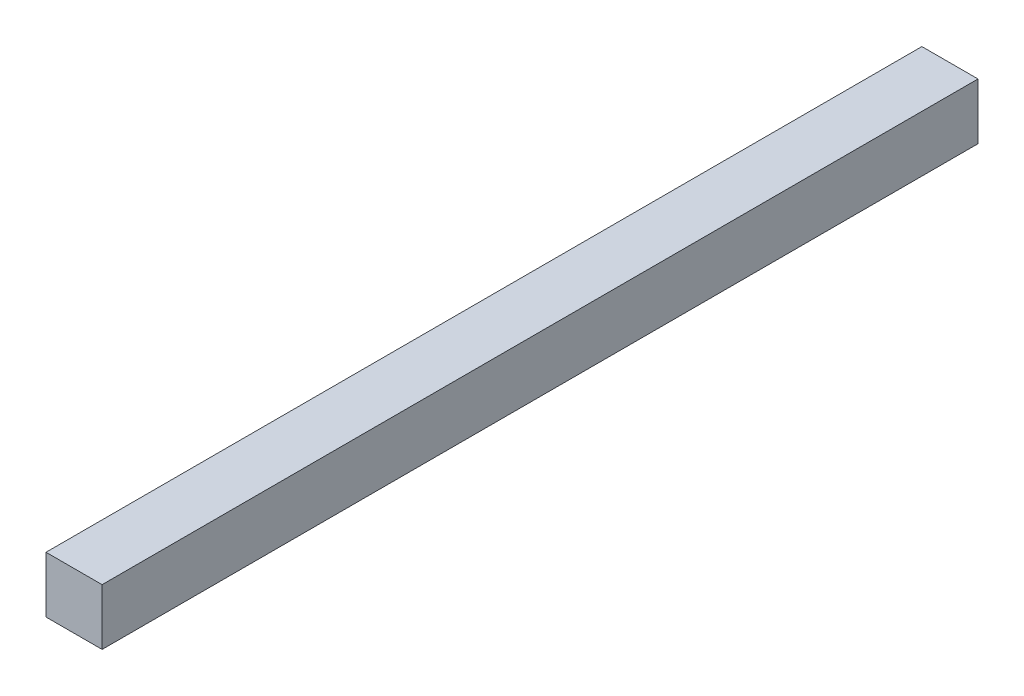
ISO-10303-21;
HEADER;
FILE_DESCRIPTION(('STEP AP214'),'2;1');
FILE_NAME('part.step','',(''),(''),'','','');
FILE_SCHEMA(('AUTOMOTIVE_DESIGN { 1 0 10303 214 1 1 1 1 }'));
ENDSEC;
DATA;
#1=APPLICATION_CONTEXT('core data for automotive mechanical design processes');
#2=APPLICATION_PROTOCOL_DEFINITION('international standard','automotive_design',2000,#1);
#3=PRODUCT_CONTEXT('',#1,'mechanical');
#4=PRODUCT('Part','Part','',(#3));
#5=PRODUCT_RELATED_PRODUCT_CATEGORY('part','',(#4));
#6=PRODUCT_DEFINITION_FORMATION('','',#4);
#7=PRODUCT_DEFINITION_CONTEXT('part definition',#1,'design');
#8=PRODUCT_DEFINITION('design','',#6,#7);
#9=PRODUCT_DEFINITION_SHAPE('','',#8);
#10=(LENGTH_UNIT() NAMED_UNIT(*) SI_UNIT(.MILLI.,.METRE.));
#11=(NAMED_UNIT(*) PLANE_ANGLE_UNIT() SI_UNIT($,.RADIAN.));
#12=(NAMED_UNIT(*) SI_UNIT($,.STERADIAN.) SOLID_ANGLE_UNIT());
#13=UNCERTAINTY_MEASURE_WITH_UNIT(LENGTH_MEASURE(1.E-05),#10,'distance_accuracy_value','');
#14=(GEOMETRIC_REPRESENTATION_CONTEXT(3) GLOBAL_UNCERTAINTY_ASSIGNED_CONTEXT((#13)) GLOBAL_UNIT_ASSIGNED_CONTEXT((#10,
#11,#12)) REPRESENTATION_CONTEXT('',''));
#15=CARTESIAN_POINT('',(0.,0.,0.));
#16=DIRECTION('',(0.,0.,1.));
#17=DIRECTION('',(1.,0.,0.));
#18=AXIS2_PLACEMENT_3D('',#15,#16,#17);
#19=CARTESIAN_POINT('',(10.,-10.,312.2));
#20=DIRECTION('',(-1.,0.,0.));
#21=DIRECTION('',(0.,0.,1.));
#22=AXIS2_PLACEMENT_3D('',#19,#20,#21);
#23=PLANE('',#22);
#24=DIRECTION('',(0.,1.,0.));
#25=VECTOR('',#24,1.);
#26=CARTESIAN_POINT('',(10.,-10.,0.));
#27=LINE('',#26,#25);
#28=CARTESIAN_POINT('',(10.,-10.,0.));
#29=VERTEX_POINT('',#28);
#30=CARTESIAN_POINT('',(10.,10.,0.));
#31=VERTEX_POINT('',#30);
#32=EDGE_CURVE('E98',#29,#31,#27,.T.);
#33=ORIENTED_EDGE('',*,*,#32,.T.);
#34=DIRECTION('',(0.,0.,-1.));
#35=VECTOR('',#34,1.);
#36=CARTESIAN_POINT('',(10.,10.,312.2));
#37=LINE('',#36,#35);
#38=CARTESIAN_POINT('',(10.,10.,312.2));
#39=VERTEX_POINT('',#38);
#40=EDGE_CURVE('E11',#39,#31,#37,.T.);
#41=ORIENTED_EDGE('',*,*,#40,.F.);
#42=DIRECTION('',(0.,1.,0.));
#43=VECTOR('',#42,1.);
#44=CARTESIAN_POINT('',(10.,-10.,312.2));
#45=LINE('',#44,#43);
#46=CARTESIAN_POINT('',(10.,-10.,312.2));
#47=VERTEX_POINT('',#46);
#48=EDGE_CURVE('E86',#47,#39,#45,.T.);
#49=ORIENTED_EDGE('',*,*,#48,.F.);
#50=DIRECTION('',(0.,0.,-1.));
#51=VECTOR('',#50,1.);
#52=CARTESIAN_POINT('',(10.,-10.,312.2));
#53=LINE('',#52,#51);
#54=EDGE_CURVE('E94',#47,#29,#53,.T.);
#55=ORIENTED_EDGE('',*,*,#54,.T.);
#56=EDGE_LOOP('',(#33,#41,#49,#55));
#57=FACE_BOUND('',#56,.T.);
#58=ADVANCED_FACE('F35',(#57),#23,.F.);
#59=CARTESIAN_POINT('',(-10.,10.,312.2));
#60=DIRECTION('',(0.,-1.,0.));
#61=DIRECTION('',(0.,0.,-1.));
#62=AXIS2_PLACEMENT_3D('',#59,#60,#61);
#63=PLANE('',#62);
#64=DIRECTION('',(-1.,0.,0.));
#65=VECTOR('',#64,1.);
#66=CARTESIAN_POINT('',(-10.,10.,0.));
#67=LINE('',#66,#65);
#68=CARTESIAN_POINT('',(-10.,10.,0.));
#69=VERTEX_POINT('',#68);
#70=EDGE_CURVE('E90',#31,#69,#67,.T.);
#71=ORIENTED_EDGE('',*,*,#70,.T.);
#72=DIRECTION('',(0.,0.,-1.));
#73=VECTOR('',#72,1.);
#74=CARTESIAN_POINT('',(-10.,10.,312.2));
#75=LINE('',#74,#73);
#76=CARTESIAN_POINT('',(-10.,10.,312.2));
#77=VERTEX_POINT('',#76);
#78=EDGE_CURVE('E43',#77,#69,#75,.T.);
#79=ORIENTED_EDGE('',*,*,#78,.F.);
#80=DIRECTION('',(-1.,0.,0.));
#81=VECTOR('',#80,1.);
#82=CARTESIAN_POINT('',(-10.,10.,312.2));
#83=LINE('',#82,#81);
#84=EDGE_CURVE('E81',#39,#77,#83,.T.);
#85=ORIENTED_EDGE('',*,*,#84,.F.);
#86=ORIENTED_EDGE('',*,*,#40,.T.);
#87=EDGE_LOOP('',(#71,#79,#85,#86));
#88=FACE_BOUND('',#87,.T.);
#89=ADVANCED_FACE('F89',(#88),#63,.F.);
#90=CARTESIAN_POINT('',(-10.,-10.,312.2));
#91=DIRECTION('',(1.,0.,0.));
#92=DIRECTION('',(0.,0.,-1.));
#93=AXIS2_PLACEMENT_3D('',#90,#91,#92);
#94=PLANE('',#93);
#95=DIRECTION('',(0.,-1.,0.));
#96=VECTOR('',#95,1.);
#97=CARTESIAN_POINT('',(-10.,-10.,0.));
#98=LINE('',#97,#96);
#99=CARTESIAN_POINT('',(-10.,-10.,0.));
#100=VERTEX_POINT('',#99);
#101=EDGE_CURVE('E68',#69,#100,#98,.T.);
#102=ORIENTED_EDGE('',*,*,#101,.T.);
#103=DIRECTION('',(0.,0.,-1.));
#104=VECTOR('',#103,1.);
#105=CARTESIAN_POINT('',(-10.,-10.,312.2));
#106=LINE('',#105,#104);
#107=CARTESIAN_POINT('',(-10.,-10.,312.2));
#108=VERTEX_POINT('',#107);
#109=EDGE_CURVE('E91',#108,#100,#106,.T.);
#110=ORIENTED_EDGE('',*,*,#109,.F.);
#111=DIRECTION('',(0.,-1.,0.));
#112=VECTOR('',#111,1.);
#113=CARTESIAN_POINT('',(-10.,-10.,312.2));
#114=LINE('',#113,#112);
#115=EDGE_CURVE('E84',#77,#108,#114,.T.);
#116=ORIENTED_EDGE('',*,*,#115,.F.);
#117=ORIENTED_EDGE('',*,*,#78,.T.);
#118=EDGE_LOOP('',(#102,#110,#116,#117));
#119=FACE_BOUND('',#118,.T.);
#120=ADVANCED_FACE('F92',(#119),#94,.F.);
#121=CARTESIAN_POINT('',(-10.,-10.,312.2));
#122=DIRECTION('',(0.,1.,0.));
#123=DIRECTION('',(0.,0.,1.));
#124=AXIS2_PLACEMENT_3D('',#121,#122,#123);
#125=PLANE('',#124);
#126=DIRECTION('',(1.,0.,0.));
#127=VECTOR('',#126,1.);
#128=CARTESIAN_POINT('',(-10.,-10.,0.));
#129=LINE('',#128,#127);
#130=EDGE_CURVE('E74',#100,#29,#129,.T.);
#131=ORIENTED_EDGE('',*,*,#130,.T.);
#132=ORIENTED_EDGE('',*,*,#54,.F.);
#133=DIRECTION('',(1.,0.,0.));
#134=VECTOR('',#133,1.);
#135=CARTESIAN_POINT('',(-10.,-10.,312.2));
#136=LINE('',#135,#134);
#137=EDGE_CURVE('E51',#108,#47,#136,.T.);
#138=ORIENTED_EDGE('',*,*,#137,.F.);
#139=ORIENTED_EDGE('',*,*,#109,.T.);
#140=EDGE_LOOP('',(#131,#132,#138,#139));
#141=FACE_BOUND('',#140,.T.);
#142=ADVANCED_FACE('F105',(#141),#125,.F.);
#143=CARTESIAN_POINT('',(0.,0.,312.2));
#144=DIRECTION('',(0.,0.,-1.));
#145=DIRECTION('',(-1.,0.,0.));
#146=AXIS2_PLACEMENT_3D('',#143,#144,#145);
#147=PLANE('',#146);
#148=ORIENTED_EDGE('',*,*,#48,.T.);
#149=ORIENTED_EDGE('',*,*,#84,.T.);
#150=ORIENTED_EDGE('',*,*,#115,.T.);
#151=ORIENTED_EDGE('',*,*,#137,.T.);
#152=EDGE_LOOP('',(#148,#149,#150,#151));
#153=FACE_BOUND('',#152,.T.);
#154=ADVANCED_FACE('F82',(#153),#147,.F.);
#155=CARTESIAN_POINT('',(0.,0.,0.));
#156=DIRECTION('',(0.,0.,-1.));
#157=DIRECTION('',(-1.,0.,0.));
#158=AXIS2_PLACEMENT_3D('',#155,#156,#157);
#159=PLANE('',#158);
#160=ORIENTED_EDGE('',*,*,#32,.F.);
#161=ORIENTED_EDGE('',*,*,#130,.F.);
#162=ORIENTED_EDGE('',*,*,#101,.F.);
#163=ORIENTED_EDGE('',*,*,#70,.F.);
#164=EDGE_LOOP('',(#160,#161,#162,#163));
#165=FACE_BOUND('',#164,.T.);
#166=ADVANCED_FACE('F108',(#165),#159,.T.);
#167=CLOSED_SHELL('',(#58,#89,#120,#142,#154,#166));
#168=MANIFOLD_SOLID_BREP('B2',#167);
#169=ADVANCED_BREP_SHAPE_REPRESENTATION('',(#18,#168),#14);
#170=SHAPE_DEFINITION_REPRESENTATION(#9,#169);
ENDSEC;
END-ISO-10303-21;
